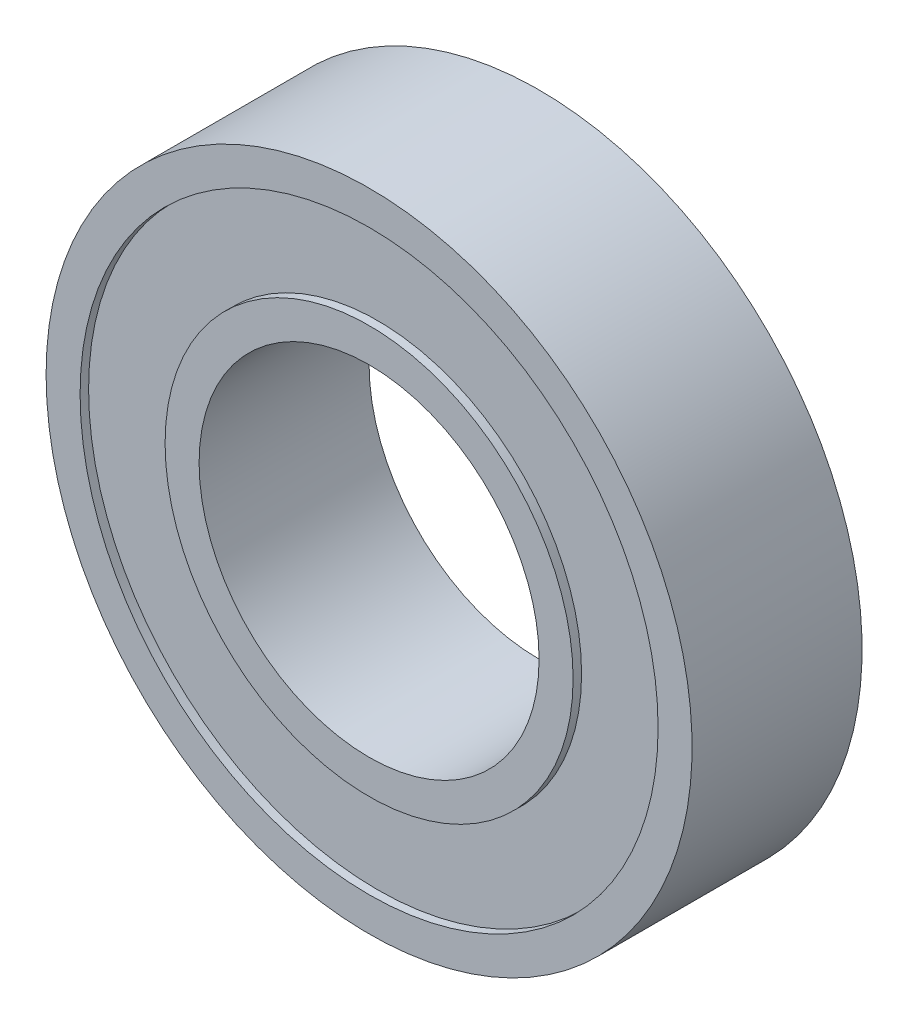
ISO-10303-21;
HEADER;
FILE_DESCRIPTION(('STEP AP214'),'2;1');
FILE_NAME('part.step','',(''),(''),'','','');
FILE_SCHEMA(('AUTOMOTIVE_DESIGN { 1 0 10303 214 1 1 1 1 }'));
ENDSEC;
DATA;
#1=APPLICATION_CONTEXT('core data for automotive mechanical design processes');
#2=APPLICATION_PROTOCOL_DEFINITION('international standard','automotive_design',2000,#1);
#3=PRODUCT_CONTEXT('',#1,'mechanical');
#4=PRODUCT('Part','Part','',(#3));
#5=PRODUCT_RELATED_PRODUCT_CATEGORY('part','',(#4));
#6=PRODUCT_DEFINITION_FORMATION('','',#4);
#7=PRODUCT_DEFINITION_CONTEXT('part definition',#1,'design');
#8=PRODUCT_DEFINITION('design','',#6,#7);
#9=PRODUCT_DEFINITION_SHAPE('','',#8);
#10=(LENGTH_UNIT() NAMED_UNIT(*) SI_UNIT(.MILLI.,.METRE.));
#11=(NAMED_UNIT(*) PLANE_ANGLE_UNIT() SI_UNIT($,.RADIAN.));
#12=(NAMED_UNIT(*) SI_UNIT($,.STERADIAN.) SOLID_ANGLE_UNIT());
#13=UNCERTAINTY_MEASURE_WITH_UNIT(LENGTH_MEASURE(1.E-05),#10,'distance_accuracy_value','');
#14=(GEOMETRIC_REPRESENTATION_CONTEXT(3) GLOBAL_UNCERTAINTY_ASSIGNED_CONTEXT((#13)) GLOBAL_UNIT_ASSIGNED_CONTEXT((#10,
#11,#12)) REPRESENTATION_CONTEXT('',''));
#15=CARTESIAN_POINT('',(0.,0.,0.));
#16=DIRECTION('',(0.,0.,1.));
#17=DIRECTION('',(1.,0.,0.));
#18=AXIS2_PLACEMENT_3D('',#15,#16,#17);
#19=CARTESIAN_POINT('',(0.,0.,-2.5));
#20=DIRECTION('',(0.,0.,-1.));
#21=DIRECTION('',(-1.,0.,0.));
#22=AXIS2_PLACEMENT_3D('',#19,#20,#21);
#23=CYLINDRICAL_SURFACE('',#22,5.);
#24=CARTESIAN_POINT('',(0.,0.,2.5));
#25=DIRECTION('',(0.,0.,-1.));
#26=DIRECTION('',(-1.,0.,0.));
#27=AXIS2_PLACEMENT_3D('',#24,#25,#26);
#28=CIRCLE('',#27,5.);
#29=CARTESIAN_POINT('',(-5.,0.,2.5));
#30=VERTEX_POINT('',#29);
#31=EDGE_CURVE('E10',#30,#30,#28,.T.);
#32=ORIENTED_EDGE('',*,*,#31,.F.);
#33=EDGE_LOOP('',(#32));
#34=FACE_BOUND('',#33,.T.);
#35=CARTESIAN_POINT('',(0.,0.,-2.5));
#36=DIRECTION('',(0.,0.,-1.));
#37=DIRECTION('',(-1.,0.,0.));
#38=AXIS2_PLACEMENT_3D('',#35,#36,#37);
#39=CIRCLE('',#38,5.);
#40=CARTESIAN_POINT('',(-5.,0.,-2.5));
#41=VERTEX_POINT('',#40);
#42=EDGE_CURVE('E74',#41,#41,#39,.T.);
#43=ORIENTED_EDGE('',*,*,#42,.T.);
#44=EDGE_LOOP('',(#43));
#45=FACE_BOUND('',#44,.T.);
#46=ADVANCED_FACE('F34',(#34,#45),#23,.F.);
#47=CARTESIAN_POINT('',(5.,0.,2.5));
#48=DIRECTION('',(0.,0.,-1.));
#49=DIRECTION('',(-1.,0.,0.));
#50=AXIS2_PLACEMENT_3D('',#47,#48,#49);
#51=PLANE('',#50);
#52=CARTESIAN_POINT('',(0.,0.,2.5));
#53=DIRECTION('',(0.,0.,-1.));
#54=DIRECTION('',(-1.,0.,0.));
#55=AXIS2_PLACEMENT_3D('',#52,#53,#54);
#56=CIRCLE('',#55,6.);
#57=CARTESIAN_POINT('',(-6.,0.,2.5));
#58=VERTEX_POINT('',#57);
#59=EDGE_CURVE('E40',#58,#58,#56,.T.);
#60=ORIENTED_EDGE('',*,*,#59,.F.);
#61=EDGE_LOOP('',(#60));
#62=FACE_BOUND('',#61,.T.);
#63=ORIENTED_EDGE('',*,*,#31,.T.);
#64=EDGE_LOOP('',(#63));
#65=FACE_BOUND('',#64,.T.);
#66=ADVANCED_FACE('F135',(#62,#65),#51,.F.);
#67=CARTESIAN_POINT('',(0.,0.,-2.5));
#68=DIRECTION('',(0.,0.,-1.));
#69=DIRECTION('',(-1.,0.,0.));
#70=AXIS2_PLACEMENT_3D('',#67,#68,#69);
#71=CYLINDRICAL_SURFACE('',#70,6.);
#72=CARTESIAN_POINT('',(0.,0.,2.25));
#73=DIRECTION('',(0.,0.,-1.));
#74=DIRECTION('',(-1.,0.,0.));
#75=AXIS2_PLACEMENT_3D('',#72,#73,#74);
#76=CIRCLE('',#75,6.);
#77=CARTESIAN_POINT('',(-6.,0.,2.25));
#78=VERTEX_POINT('',#77);
#79=EDGE_CURVE('E44',#78,#78,#76,.T.);
#80=ORIENTED_EDGE('',*,*,#79,.F.);
#81=EDGE_LOOP('',(#80));
#82=FACE_BOUND('',#81,.T.);
#83=ORIENTED_EDGE('',*,*,#59,.T.);
#84=EDGE_LOOP('',(#83));
#85=FACE_BOUND('',#84,.T.);
#86=ADVANCED_FACE('F130',(#82,#85),#71,.T.);
#87=CARTESIAN_POINT('',(6.,0.,2.25));
#88=DIRECTION('',(0.,0.,-1.));
#89=DIRECTION('',(-1.,0.,0.));
#90=AXIS2_PLACEMENT_3D('',#87,#88,#89);
#91=PLANE('',#90);
#92=CARTESIAN_POINT('',(0.,0.,2.25));
#93=DIRECTION('',(0.,0.,-1.));
#94=DIRECTION('',(-1.,0.,0.));
#95=AXIS2_PLACEMENT_3D('',#92,#93,#94);
#96=CIRCLE('',#95,8.5);
#97=CARTESIAN_POINT('',(-8.5,0.,2.25));
#98=VERTEX_POINT('',#97);
#99=EDGE_CURVE('E48',#98,#98,#96,.T.);
#100=ORIENTED_EDGE('',*,*,#99,.F.);
#101=EDGE_LOOP('',(#100));
#102=FACE_BOUND('',#101,.T.);
#103=ORIENTED_EDGE('',*,*,#79,.T.);
#104=EDGE_LOOP('',(#103));
#105=FACE_BOUND('',#104,.T.);
#106=ADVANCED_FACE('F124',(#102,#105),#91,.F.);
#107=CARTESIAN_POINT('',(0.,0.,-2.5));
#108=DIRECTION('',(0.,0.,-1.));
#109=DIRECTION('',(-1.,0.,0.));
#110=AXIS2_PLACEMENT_3D('',#107,#108,#109);
#111=CYLINDRICAL_SURFACE('',#110,8.5);
#112=CARTESIAN_POINT('',(0.,0.,2.5));
#113=DIRECTION('',(0.,0.,-1.));
#114=DIRECTION('',(-1.,0.,0.));
#115=AXIS2_PLACEMENT_3D('',#112,#113,#114);
#116=CIRCLE('',#115,8.5);
#117=CARTESIAN_POINT('',(-8.5,0.,2.5));
#118=VERTEX_POINT('',#117);
#119=EDGE_CURVE('E53',#118,#118,#116,.T.);
#120=ORIENTED_EDGE('',*,*,#119,.F.);
#121=EDGE_LOOP('',(#120));
#122=FACE_BOUND('',#121,.T.);
#123=ORIENTED_EDGE('',*,*,#99,.T.);
#124=EDGE_LOOP('',(#123));
#125=FACE_BOUND('',#124,.T.);
#126=ADVANCED_FACE('F118',(#122,#125),#111,.F.);
#127=CARTESIAN_POINT('',(8.5,0.,2.5));
#128=DIRECTION('',(0.,0.,-1.));
#129=DIRECTION('',(-1.,0.,0.));
#130=AXIS2_PLACEMENT_3D('',#127,#128,#129);
#131=PLANE('',#130);
#132=CARTESIAN_POINT('',(0.,0.,2.5));
#133=DIRECTION('',(0.,0.,-1.));
#134=DIRECTION('',(-1.,0.,0.));
#135=AXIS2_PLACEMENT_3D('',#132,#133,#134);
#136=CIRCLE('',#135,9.5);
#137=CARTESIAN_POINT('',(-9.5,0.,2.5));
#138=VERTEX_POINT('',#137);
#139=EDGE_CURVE('E56',#138,#138,#136,.T.);
#140=ORIENTED_EDGE('',*,*,#139,.F.);
#141=EDGE_LOOP('',(#140));
#142=FACE_BOUND('',#141,.T.);
#143=ORIENTED_EDGE('',*,*,#119,.T.);
#144=EDGE_LOOP('',(#143));
#145=FACE_BOUND('',#144,.T.);
#146=ADVANCED_FACE('F112',(#142,#145),#131,.F.);
#147=CARTESIAN_POINT('',(0.,0.,-2.5));
#148=DIRECTION('',(0.,0.,-1.));
#149=DIRECTION('',(-1.,0.,0.));
#150=AXIS2_PLACEMENT_3D('',#147,#148,#149);
#151=CYLINDRICAL_SURFACE('',#150,9.5);
#152=CARTESIAN_POINT('',(0.,0.,-2.5));
#153=DIRECTION('',(0.,0.,-1.));
#154=DIRECTION('',(-1.,0.,0.));
#155=AXIS2_PLACEMENT_3D('',#152,#153,#154);
#156=CIRCLE('',#155,9.5);
#157=CARTESIAN_POINT('',(-9.5,0.,-2.5));
#158=VERTEX_POINT('',#157);
#159=EDGE_CURVE('E59',#158,#158,#156,.T.);
#160=ORIENTED_EDGE('',*,*,#159,.F.);
#161=EDGE_LOOP('',(#160));
#162=FACE_BOUND('',#161,.T.);
#163=ORIENTED_EDGE('',*,*,#139,.T.);
#164=EDGE_LOOP('',(#163));
#165=FACE_BOUND('',#164,.T.);
#166=ADVANCED_FACE('F106',(#162,#165),#151,.T.);
#167=CARTESIAN_POINT('',(9.5,0.,-2.5));
#168=DIRECTION('',(0.,0.,1.));
#169=DIRECTION('',(1.,0.,0.));
#170=AXIS2_PLACEMENT_3D('',#167,#168,#169);
#171=PLANE('',#170);
#172=CARTESIAN_POINT('',(0.,0.,-2.5));
#173=DIRECTION('',(0.,0.,-1.));
#174=DIRECTION('',(-1.,0.,0.));
#175=AXIS2_PLACEMENT_3D('',#172,#173,#174);
#176=CIRCLE('',#175,8.5);
#177=CARTESIAN_POINT('',(-8.5,0.,-2.5));
#178=VERTEX_POINT('',#177);
#179=EDGE_CURVE('E62',#178,#178,#176,.T.);
#180=ORIENTED_EDGE('',*,*,#179,.F.);
#181=EDGE_LOOP('',(#180));
#182=FACE_BOUND('',#181,.T.);
#183=ORIENTED_EDGE('',*,*,#159,.T.);
#184=EDGE_LOOP('',(#183));
#185=FACE_BOUND('',#184,.T.);
#186=ADVANCED_FACE('F100',(#182,#185),#171,.F.);
#187=CARTESIAN_POINT('',(0.,0.,-2.5));
#188=DIRECTION('',(0.,0.,-1.));
#189=DIRECTION('',(-1.,0.,0.));
#190=AXIS2_PLACEMENT_3D('',#187,#188,#189);
#191=CYLINDRICAL_SURFACE('',#190,8.5);
#192=CARTESIAN_POINT('',(0.,0.,-2.25));
#193=DIRECTION('',(0.,0.,-1.));
#194=DIRECTION('',(-1.,0.,0.));
#195=AXIS2_PLACEMENT_3D('',#192,#193,#194);
#196=CIRCLE('',#195,8.5);
#197=CARTESIAN_POINT('',(-8.5,0.,-2.25));
#198=VERTEX_POINT('',#197);
#199=EDGE_CURVE('E65',#198,#198,#196,.T.);
#200=ORIENTED_EDGE('',*,*,#199,.F.);
#201=EDGE_LOOP('',(#200));
#202=FACE_BOUND('',#201,.T.);
#203=ORIENTED_EDGE('',*,*,#179,.T.);
#204=EDGE_LOOP('',(#203));
#205=FACE_BOUND('',#204,.T.);
#206=ADVANCED_FACE('F94',(#202,#205),#191,.F.);
#207=CARTESIAN_POINT('',(8.5,0.,-2.25));
#208=DIRECTION('',(0.,0.,1.));
#209=DIRECTION('',(1.,0.,0.));
#210=AXIS2_PLACEMENT_3D('',#207,#208,#209);
#211=PLANE('',#210);
#212=CARTESIAN_POINT('',(0.,0.,-2.25));
#213=DIRECTION('',(0.,0.,-1.));
#214=DIRECTION('',(-1.,0.,0.));
#215=AXIS2_PLACEMENT_3D('',#212,#213,#214);
#216=CIRCLE('',#215,6.);
#217=CARTESIAN_POINT('',(-6.,0.,-2.25));
#218=VERTEX_POINT('',#217);
#219=EDGE_CURVE('E68',#218,#218,#216,.T.);
#220=ORIENTED_EDGE('',*,*,#219,.F.);
#221=EDGE_LOOP('',(#220));
#222=FACE_BOUND('',#221,.T.);
#223=ORIENTED_EDGE('',*,*,#199,.T.);
#224=EDGE_LOOP('',(#223));
#225=FACE_BOUND('',#224,.T.);
#226=ADVANCED_FACE('F88',(#222,#225),#211,.F.);
#227=CARTESIAN_POINT('',(0.,0.,-2.5));
#228=DIRECTION('',(0.,0.,-1.));
#229=DIRECTION('',(-1.,0.,0.));
#230=AXIS2_PLACEMENT_3D('',#227,#228,#229);
#231=CYLINDRICAL_SURFACE('',#230,6.);
#232=CARTESIAN_POINT('',(0.,0.,-2.5));
#233=DIRECTION('',(0.,0.,-1.));
#234=DIRECTION('',(-1.,0.,0.));
#235=AXIS2_PLACEMENT_3D('',#232,#233,#234);
#236=CIRCLE('',#235,6.);
#237=CARTESIAN_POINT('',(-6.,0.,-2.5));
#238=VERTEX_POINT('',#237);
#239=EDGE_CURVE('E71',#238,#238,#236,.T.);
#240=ORIENTED_EDGE('',*,*,#239,.F.);
#241=EDGE_LOOP('',(#240));
#242=FACE_BOUND('',#241,.T.);
#243=ORIENTED_EDGE('',*,*,#219,.T.);
#244=EDGE_LOOP('',(#243));
#245=FACE_BOUND('',#244,.T.);
#246=ADVANCED_FACE('F82',(#242,#245),#231,.T.);
#247=CARTESIAN_POINT('',(6.,0.,-2.5));
#248=DIRECTION('',(0.,0.,1.));
#249=DIRECTION('',(1.,0.,0.));
#250=AXIS2_PLACEMENT_3D('',#247,#248,#249);
#251=PLANE('',#250);
#252=ORIENTED_EDGE('',*,*,#42,.F.);
#253=EDGE_LOOP('',(#252));
#254=FACE_BOUND('',#253,.T.);
#255=ORIENTED_EDGE('',*,*,#239,.T.);
#256=EDGE_LOOP('',(#255));
#257=FACE_BOUND('',#256,.T.);
#258=ADVANCED_FACE('F79',(#254,#257),#251,.F.);
#259=CLOSED_SHELL('',(#46,#66,#86,#106,#126,#146,#166,#186,#206,#226,#246,#258));
#260=MANIFOLD_SOLID_BREP('B2',#259);
#261=ADVANCED_BREP_SHAPE_REPRESENTATION('',(#18,#260),#14);
#262=SHAPE_DEFINITION_REPRESENTATION(#9,#261);
ENDSEC;
END-ISO-10303-21;
